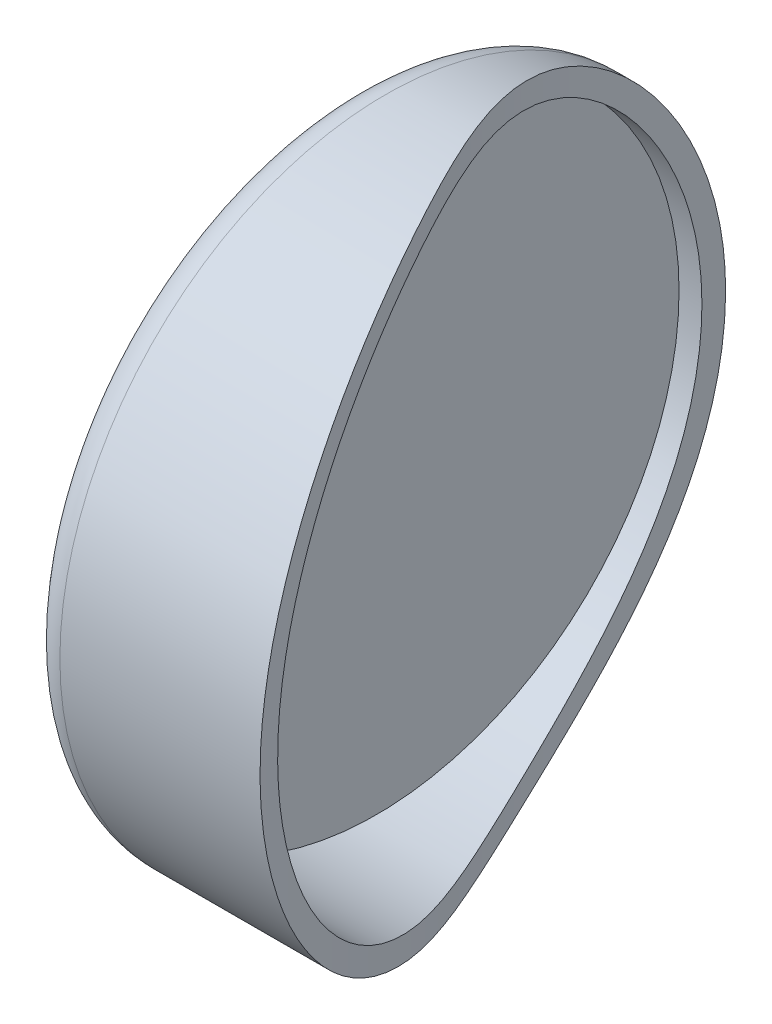
ISO-10303-21;
HEADER;
FILE_DESCRIPTION(('STEP AP214'),'2;1');
FILE_NAME('part.step','',(''),(''),'','','');
FILE_SCHEMA(('AUTOMOTIVE_DESIGN { 1 0 10303 214 1 1 1 1 }'));
ENDSEC;
DATA;
#1=APPLICATION_CONTEXT('core data for automotive mechanical design processes');
#2=APPLICATION_PROTOCOL_DEFINITION('international standard','automotive_design',2000,#1);
#3=PRODUCT_CONTEXT('',#1,'mechanical');
#4=PRODUCT('Part','Part','',(#3));
#5=PRODUCT_RELATED_PRODUCT_CATEGORY('part','',(#4));
#6=PRODUCT_DEFINITION_FORMATION('','',#4);
#7=PRODUCT_DEFINITION_CONTEXT('part definition',#1,'design');
#8=PRODUCT_DEFINITION('design','',#6,#7);
#9=PRODUCT_DEFINITION_SHAPE('','',#8);
#10=(LENGTH_UNIT() NAMED_UNIT(*) SI_UNIT(.MILLI.,.METRE.));
#11=(NAMED_UNIT(*) PLANE_ANGLE_UNIT() SI_UNIT($,.RADIAN.));
#12=(NAMED_UNIT(*) SI_UNIT($,.STERADIAN.) SOLID_ANGLE_UNIT());
#13=UNCERTAINTY_MEASURE_WITH_UNIT(LENGTH_MEASURE(1.E-05),#10,'distance_accuracy_value','');
#14=(GEOMETRIC_REPRESENTATION_CONTEXT(3) GLOBAL_UNCERTAINTY_ASSIGNED_CONTEXT((#13)) GLOBAL_UNIT_ASSIGNED_CONTEXT((#10,
#11,#12)) REPRESENTATION_CONTEXT('',''));
#15=CARTESIAN_POINT('',(0.,0.,0.));
#16=DIRECTION('',(0.,0.,1.));
#17=DIRECTION('',(1.,0.,0.));
#18=AXIS2_PLACEMENT_3D('',#15,#16,#17);
#19=CARTESIAN_POINT('',(50.,0.,0.));
#20=DIRECTION('',(-1.,0.,0.));
#21=DIRECTION('',(0.,0.,1.));
#22=AXIS2_PLACEMENT_3D('',#19,#20,#21);
#23=CYLINDRICAL_SURFACE('',#22,70.);
#24=CARTESIAN_POINT('',(7.,0.,0.));
#25=DIRECTION('',(1.,0.,0.));
#26=DIRECTION('',(0.,0.,-1.));
#27=AXIS2_PLACEMENT_3D('',#24,#25,#26);
#28=CIRCLE('',#27,70.);
#29=CARTESIAN_POINT('',(7.,0.,-70.));
#30=VERTEX_POINT('',#29);
#31=EDGE_CURVE('E52',#30,#30,#28,.T.);
#32=ORIENTED_EDGE('',*,*,#31,.T.);
#33=EDGE_LOOP('',(#32));
#34=FACE_BOUND('',#33,.T.);
#35=CARTESIAN_POINT('',(50.,0.,70.));
#36=CARTESIAN_POINT('',(50.0000018003316,1.91130000398539,69.9999962525769));
#37=CARTESIAN_POINT('',(49.9823059619208,3.82266490187084,69.9216631907981));
#38=CARTESIAN_POINT('',(49.9107786034703,7.63195740908031,69.6089486036693));
#39=CARTESIAN_POINT('',(49.8569455766294,9.52988445475555,69.3745605713471));
#40=CARTESIAN_POINT('',(49.7110853451611,13.298961887616,68.7516272956741));
#41=CARTESIAN_POINT('',(49.6190550008448,15.1701100605876,68.3630693802023));
#42=CARTESIAN_POINT('',(49.3939428916241,18.8720619893456,67.4350547678297));
#43=CARTESIAN_POINT('',(49.2608617481148,20.7028663553758,66.8956003550947));
#44=CARTESIAN_POINT('',(48.9505515883576,24.3113521581381,65.6703082779987));
#45=CARTESIAN_POINT('',(48.7733145159935,26.0890238346137,64.9844439048544));
#46=CARTESIAN_POINT('',(48.3719560001871,29.5781725991728,63.4724097122345));
#47=CARTESIAN_POINT('',(48.1478345356526,31.2896496574761,62.6462398296384));
#48=CARTESIAN_POINT('',(47.6506613438221,34.6341848102122,60.86103950687));
#49=CARTESIAN_POINT('',(47.3776144183036,36.2672505803761,59.9020221070789));
#50=CARTESIAN_POINT('',(46.7813553529707,39.4439895004782,57.8596360224635));
#51=CARTESIAN_POINT('',(46.4581432229093,40.9876626677959,56.7762673618155));
#52=CARTESIAN_POINT('',(45.7618353126724,43.9728757710367,54.4968512209325));
#53=CARTESIAN_POINT('',(45.3888303684963,45.4145945419111,53.3010100686265));
#54=CARTESIAN_POINT('',(44.5929291213869,48.190206523011,50.8053836716068));
#55=CARTESIAN_POINT('',(44.1700329584453,49.5241000357696,49.5055987185563));
#56=CARTESIAN_POINT('',(43.2753925222116,52.0767967651697,46.812923744282));
#57=CARTESIAN_POINT('',(42.8036417238308,53.2955845664718,45.4200212949936));
#58=CARTESIAN_POINT('',(41.8128483553499,55.6119088401151,42.5524623568207));
#59=CARTESIAN_POINT('',(41.2938048433208,56.7094428964819,41.0778042398379));
#60=CARTESIAN_POINT('',(40.3794236056434,58.4556011825207,38.5295906756666));
#61=CARTESIAN_POINT('',(39.995984212328,59.1374837269307,37.4743593249841));
#62=CARTESIAN_POINT('',(39.2082563656509,60.4404359608465,35.3344390659105));
#63=CARTESIAN_POINT('',(38.803967418465,61.0615042089472,34.2497494600854));
#64=CARTESIAN_POINT('',(37.9752201629652,62.2418240149578,32.0547696084488));
#65=CARTESIAN_POINT('',(37.5507617294224,62.8010751889844,30.9444792037084));
#66=CARTESIAN_POINT('',(36.6823773872359,63.8569983359353,28.7022508909051));
#67=CARTESIAN_POINT('',(36.2384546631374,64.3536804946315,27.5703165409622));
#68=CARTESIAN_POINT('',(35.3316242416914,65.2841450392752,25.2883080234928));
#69=CARTESIAN_POINT('',(34.8687168042539,65.7179282859708,24.1382341044382));
#70=CARTESIAN_POINT('',(34.1605388654334,66.3212257353159,22.402464514663));
#71=CARTESIAN_POINT('',(33.9221682900473,66.51443449884,21.8220779847266));
#72=CARTESIAN_POINT('',(33.4408441507808,66.8850746069647,20.6581641324341));
#73=CARTESIAN_POINT('',(33.1978906495045,67.062506166897,20.0746368530592));
#74=CARTESIAN_POINT('',(32.7567089219999,67.3675392623906,19.0223941749003));
#75=CARTESIAN_POINT('',(32.5592985218957,67.4979914500122,18.5541586718265));
#76=CARTESIAN_POINT('',(32.1615756327022,67.7488307492125,17.6162309447409));
#77=CARTESIAN_POINT('',(31.9612631764652,67.8692179746267,17.1465387372667));
#78=CARTESIAN_POINT('',(31.5579662400618,68.099971499391,16.2058152093342));
#79=CARTESIAN_POINT('',(31.3549816403137,68.2103373485156,15.734783829691));
#80=CARTESIAN_POINT('',(30.946662312012,68.4210833977731,14.7915140927725));
#81=CARTESIAN_POINT('',(30.7413275750215,68.5214635620455,14.319275731169));
#82=CARTESIAN_POINT('',(30.122232236501,68.8076974343487,12.9008318853234));
#83=CARTESIAN_POINT('',(29.7053893942726,68.9786394560444,11.9529183148476));
#84=CARTESIAN_POINT('',(28.8662186125377,69.2810006459276,10.0532607918036));
#85=CARTESIAN_POINT('',(28.4438906404444,69.4124195791994,9.10151681650242));
#86=CARTESIAN_POINT('',(27.595858839554,69.6361051990004,7.19289203604649));
#87=CARTESIAN_POINT('',(27.1701503602873,69.7283022098274,6.23600512200615));
#88=CARTESIAN_POINT('',(26.3191547951072,69.8732344656959,4.31913380809848));
#89=CARTESIAN_POINT('',(25.8938676849327,69.9259721325379,3.35914960195867));
#90=CARTESIAN_POINT('',(25.0467884748518,69.991875964692,1.43624233619641));
#91=CARTESIAN_POINT('',(24.6249964783283,70.0050409636096,0.47331919078682));
#92=CARTESIAN_POINT('',(23.7879949621204,69.9915150958389,-1.4553026518381));
#93=CARTESIAN_POINT('',(23.3727865723823,69.9648174607671,-2.42100179260845));
#94=CARTESIAN_POINT('',(22.5085018262151,69.8661450251981,-4.45740766110544));
#95=CARTESIAN_POINT('',(22.0605171785261,69.7896588296474,-5.52836432245546));
#96=CARTESIAN_POINT('',(21.1805109326669,69.5866117243761,-7.67221166687009));
#97=CARTESIAN_POINT('',(20.7484906137398,69.4600468112537,-8.7451024977289));
#98=CARTESIAN_POINT('',(19.9042218988581,69.1559939890128,-10.8914255270733));
#99=CARTESIAN_POINT('',(19.4919725657759,68.9785084962758,-11.964857697458));
#100=CARTESIAN_POINT('',(18.6905294533441,68.5717310470367,-14.1106404103873));
#101=CARTESIAN_POINT('',(18.3013373608329,68.3424353060558,-15.1829908681679));
#102=CARTESIAN_POINT('',(17.5498597092219,67.8319653328452,-17.3213568419703));
#103=CARTESIAN_POINT('',(17.1875038101539,67.5509339785347,-18.3873816560336));
#104=CARTESIAN_POINT('',(16.4906433722979,66.9359760726796,-20.5134027174912));
#105=CARTESIAN_POINT('',(16.1561413566166,66.6020447371957,-21.5733984106603));
#106=CARTESIAN_POINT('',(15.5165191133858,65.8810422115986,-23.6839951573259));
#107=CARTESIAN_POINT('',(15.2113949025932,65.4939782428823,-24.734597466869));
#108=CARTESIAN_POINT('',(14.6312785639093,64.6667924266737,-26.8228828704973));
#109=CARTESIAN_POINT('',(14.3562801854709,64.2266816253588,-27.8605686047764));
#110=CARTESIAN_POINT('',(13.8010099571301,63.2301833421241,-30.0598177833477));
#111=CARTESIAN_POINT('',(13.5251135270588,62.6661228327089,-31.2190213390867));
#112=CARTESIAN_POINT('',(13.011326826359,61.4710446598636,-33.5109071863992));
#113=CARTESIAN_POINT('',(12.7734340457399,60.8400314229811,-34.6435912252615));
#114=CARTESIAN_POINT('',(12.333854117487,59.5126784688247,-36.8772114946731));
#115=CARTESIAN_POINT('',(12.1321658208053,58.8163408258673,-37.9781487318627));
#116=CARTESIAN_POINT('',(11.7623832390699,57.3598177610642,-40.1441923584439));
#117=CARTESIAN_POINT('',(11.5943182763706,56.5995774240628,-41.2092668051838));
#118=CARTESIAN_POINT('',(11.2890779783303,55.018248739185,-43.2978978767897));
#119=CARTESIAN_POINT('',(11.1519033205706,54.1971590570984,-44.3214535905354));
#120=CARTESIAN_POINT('',(10.9052640321049,52.4970736852052,-46.3225793045326));
#121=CARTESIAN_POINT('',(10.7957978854337,51.6180811666486,-47.3001518181957));
#122=CARTESIAN_POINT('',(10.5638150743501,49.4563423753804,-49.5720104752358));
#123=CARTESIAN_POINT('',(10.4524672424479,48.1483157113886,-50.8435285410729));
#124=CARTESIAN_POINT('',(10.2677596510069,45.435716050429,-53.2815356800938));
#125=CARTESIAN_POINT('',(10.1943970516486,44.031150279731,-54.4480325993907));
#126=CARTESIAN_POINT('',(10.0773330183528,41.1347612746575,-56.6679766408525));
#127=CARTESIAN_POINT('',(10.0336239765413,39.6429605279277,-57.7214527010509));
#128=CARTESIAN_POINT('',(9.96826236017668,36.5812333208901,-59.7088341594736));
#129=CARTESIAN_POINT('',(9.94661092548707,35.0113028274945,-60.6427333761859));
#130=CARTESIAN_POINT('',(9.91789279828104,31.7153076487677,-62.432728815322));
#131=CARTESIAN_POINT('',(9.91168899033256,29.9854000882016,-63.2817715472802));
#132=CARTESIAN_POINT('',(9.90963057033029,26.4614692253321,-64.8343903711833));
#133=CARTESIAN_POINT('',(9.91377625696378,24.6674440740624,-65.5379622641929));
#134=CARTESIAN_POINT('',(9.92690900767121,21.0271909461663,-66.7949525017638));
#135=CARTESIAN_POINT('',(9.9358969405273,19.1809536581247,-67.3483438745592));
#136=CARTESIAN_POINT('',(9.95442410362848,15.4491474555595,-68.3010427693062));
#137=CARTESIAN_POINT('',(9.9639633366546,13.5635783426586,-68.700349513905));
#138=CARTESIAN_POINT('',(9.98069434019879,9.72605989045413,-69.3488966953937));
#139=CARTESIAN_POINT('',(9.98783266929288,7.77354781380426,-69.5948134151373));
#140=CARTESIAN_POINT('',(9.99751835051571,3.8547012137418,-69.9214359056832));
#141=CARTESIAN_POINT('',(10.0000656266398,1.88836646203667,-70.0021389413863));
#142=CARTESIAN_POINT('',(9.99993169721231,-2.04406650629275,-69.9977744782511));
#143=CARTESIAN_POINT('',(9.99725045001398,-4.01016472090822,-69.9127056589933));
#144=CARTESIAN_POINT('',(9.98732402555103,-7.92846657601206,-69.5773265396055));
#145=CARTESIAN_POINT('',(9.98007886408241,-9.88067026456663,-69.3270168113848));
#146=CARTESIAN_POINT('',(9.96731124831394,-12.7879971193687,-68.8290335349409));
#147=CARTESIAN_POINT('',(9.96273656611362,-13.7539839048279,-68.6425222345954));
#148=CARTESIAN_POINT('',(9.95334461017676,-15.6772152950928,-68.2289668116408));
#149=CARTESIAN_POINT('',(9.94852735912667,-16.6344607075866,-68.0019264745069));
#150=CARTESIAN_POINT('',(9.93910173505499,-18.5386086016579,-67.5076864516678));
#151=CARTESIAN_POINT('',(9.9344933822661,-19.4855100746676,-67.240482886752));
#152=CARTESIAN_POINT('',(9.92602756218746,-21.3671303601561,-66.6664316827342));
#153=CARTESIAN_POINT('',(9.92217002457231,-22.3018503059629,-66.3595877610451));
#154=CARTESIAN_POINT('',(9.91582738289556,-24.1577060829675,-65.7067199036378));
#155=CARTESIAN_POINT('',(9.91334253589435,-25.0788393384055,-65.3606886440135));
#156=CARTESIAN_POINT('',(9.91045318599057,-26.9056199120294,-64.6301417881728));
#157=CARTESIAN_POINT('',(9.91004848704367,-27.8112686815381,-64.2456298220675));
#158=CARTESIAN_POINT('',(9.9121083648527,-29.6056405703085,-63.4387409206909));
#159=CARTESIAN_POINT('',(9.91457321785877,-30.4943620516179,-63.0163603434433));
#160=CARTESIAN_POINT('',(9.92324431748104,-32.2531149258016,-62.1345650745391));
#161=CARTESIAN_POINT('',(9.92945020744462,-33.1231480921431,-61.6751539168176));
#162=CARTESIAN_POINT('',(9.94655729286336,-34.8431509957535,-60.7200346663467));
#163=CARTESIAN_POINT('',(9.95745906068776,-35.6931182739139,-60.2243221550278));
#164=CARTESIAN_POINT('',(9.98498969290842,-37.3712576458986,-59.1976061975909));
#165=CARTESIAN_POINT('',(10.0016180017531,-38.1994318455588,-58.6666061788674));
#166=CARTESIAN_POINT('',(10.0417133348979,-39.8326448286116,-57.5701995666731));
#167=CARTESIAN_POINT('',(10.0651810927974,-40.6376811200508,-57.0047892875077));
#168=CARTESIAN_POINT('',(10.120133531042,-42.2229606282549,-55.8407425206644));
#169=CARTESIAN_POINT('',(10.1516174150298,-43.003206299174,-55.2421093381136));
#170=CARTESIAN_POINT('',(10.2238533783861,-44.5376024616365,-54.0126699692889));
#171=CARTESIAN_POINT('',(10.2646062994534,-45.2917505761537,-53.3818608652352));
#172=CARTESIAN_POINT('',(10.3566773588878,-46.7723778991138,-52.0894444651618));
#173=CARTESIAN_POINT('',(10.4079944302186,-47.4988598932092,-51.4278402848302));
#174=CARTESIAN_POINT('',(10.5225481870651,-48.9229050475497,-50.0750820657441));
#175=CARTESIAN_POINT('',(10.585785708671,-49.6204661751205,-49.383925956873));
#176=CARTESIAN_POINT('',(10.7255442842335,-50.9852059708672,-47.9736558333663));
#177=CARTESIAN_POINT('',(10.8020643537504,-51.6523868860583,-47.2545438937479));
#178=CARTESIAN_POINT('',(10.9954453810907,-53.1545361657706,-45.5657052763155));
#179=CARTESIAN_POINT('',(11.1174855679789,-53.9783735020094,-44.5866267002481));
#180=CARTESIAN_POINT('',(11.3896072386892,-55.5694010164453,-42.5872518302571));
#181=CARTESIAN_POINT('',(11.5396884652288,-56.3365917142974,-41.5669559145789));
#182=CARTESIAN_POINT('',(11.8707271293927,-57.8119043943884,-39.4893259895876));
#183=CARTESIAN_POINT('',(12.051684225645,-58.5200270295709,-38.4319923898759));
#184=CARTESIAN_POINT('',(12.4467723318948,-59.8743953988679,-36.2858819065703));
#185=CARTESIAN_POINT('',(12.6608706085665,-60.520701180842,-35.1971369019401));
#186=CARTESIAN_POINT('',(13.1243412655142,-61.7504798330987,-32.9919992815944));
#187=CARTESIAN_POINT('',(13.3737140309426,-62.3339520171964,-31.875606364109));
#188=CARTESIAN_POINT('',(13.908989341291,-63.4367223363465,-29.6202266058435));
#189=CARTESIAN_POINT('',(14.1948888764819,-63.9560257518435,-28.481241633126));
#190=CARTESIAN_POINT('',(14.7870007668948,-64.9031297731725,-26.248299369771));
#191=CARTESIAN_POINT('',(15.0912501527951,-65.3343793700186,-25.155281493156));
#192=CARTESIAN_POINT('',(15.7322959111235,-66.1386694474769,-22.9574760107763));
#193=CARTESIAN_POINT('',(16.0690916587054,-66.5117110452442,-21.8526886313323));
#194=CARTESIAN_POINT('',(16.7739052056624,-67.1997703987994,-19.635137655809));
#195=CARTESIAN_POINT('',(17.1419213644498,-67.5147912007409,-18.5223744816561));
#196=CARTESIAN_POINT('',(17.9073654319662,-68.0876333249757,-16.2911640324334));
#197=CARTESIAN_POINT('',(18.304818180291,-68.3454055884976,-15.1727127159646));
#198=CARTESIAN_POINT('',(19.1259266504068,-68.8042352773989,-12.9337991694097));
#199=CARTESIAN_POINT('',(19.5495831537237,-69.0052910102146,-11.8133368803152));
#200=CARTESIAN_POINT('',(20.4194749878796,-69.351650935617,-9.57256070212649));
#201=CARTESIAN_POINT('',(20.8657111432286,-69.4969530906623,-8.45224681995128));
#202=CARTESIAN_POINT('',(21.8029236228948,-69.7396021865805,-6.14864083354949));
#203=CARTESIAN_POINT('',(22.2949950537794,-69.833691207904,-4.96545207312956));
#204=CARTESIAN_POINT('',(23.2943371738176,-69.9616214851268,-2.60227870028331));
#205=CARTESIAN_POINT('',(23.8016079566184,-69.9954623697438,-1.4222941076476));
#206=CARTESIAN_POINT('',(24.8256968585898,-70.0036851984277,0.933745043314098));
#207=CARTESIAN_POINT('',(25.3425152266848,-69.9780655900655,2.10979949822696));
#208=CARTESIAN_POINT('',(26.3801605579951,-69.8677959374934,4.45792566584816));
#209=CARTESIAN_POINT('',(26.9009890560284,-69.7831220541234,5.62999557799192));
#210=CARTESIAN_POINT('',(27.940791430971,-69.554823454001,7.9691566593811));
#211=CARTESIAN_POINT('',(28.4597653612317,-69.4112004470686,9.13624797203889));
#212=CARTESIAN_POINT('',(29.4905725156273,-69.0647472471468,11.4650119451505));
#213=CARTESIAN_POINT('',(30.0024049318957,-68.8619104117292,12.6266839828249));
#214=CARTESIAN_POINT('',(30.8120443784411,-68.4894331984931,14.4810771709049));
#215=CARTESIAN_POINT('',(31.1137627088467,-68.3388396558175,15.1759689701381));
#216=CARTESIAN_POINT('',(31.711812066947,-68.0159703259904,16.5630573984598));
#217=CARTESIAN_POINT('',(32.0081430357659,-67.8436943020439,17.2552539980288));
#218=CARTESIAN_POINT('',(32.5945677433735,-67.4773054021987,18.6366258499878));
#219=CARTESIAN_POINT('',(32.8846606393817,-67.2831895974916,19.32580068424));
#220=CARTESIAN_POINT('',(33.4585450360848,-66.8731231894858,20.7002375834037));
#221=CARTESIAN_POINT('',(33.7423365426429,-66.6571726065044,21.3854996519554));
#222=CARTESIAN_POINT('',(34.5841868069969,-65.9765152834804,23.4343850894553));
#223=CARTESIAN_POINT('',(35.1327529772339,-65.4789831966058,24.7911824192496));
#224=CARTESIAN_POINT('',(36.2035570538037,-64.3968867861036,27.4798267175134));
#225=CARTESIAN_POINT('',(36.7257997534032,-63.8123383845579,28.8116782004386));
#226=CARTESIAN_POINT('',(37.7431651507648,-62.5568502822304,31.4446754537666));
#227=CARTESIAN_POINT('',(38.2382883585922,-61.885912207067,32.7458218014115));
#228=CARTESIAN_POINT('',(39.2003681881327,-60.4588293643387,35.3112440322753));
#229=CARTESIAN_POINT('',(39.6673270991599,-59.7026915365417,36.5755229079128));
#230=CARTESIAN_POINT('',(40.4340311659548,-58.3503227318509,38.6819569344223));
#231=CARTESIAN_POINT('',(40.7413451358505,-57.775640745325,39.5352724520332));
#232=CARTESIAN_POINT('',(41.3415406580416,-56.5865981296316,41.2191597451639));
#233=CARTESIAN_POINT('',(41.634421383488,-55.9722352318794,42.0497302164617));
#234=CARTESIAN_POINT('',(42.2053453880156,-54.7047999337175,43.6858743300623));
#235=CARTESIAN_POINT('',(42.4833906062773,-54.0517326161155,44.4914512335377));
#236=CARTESIAN_POINT('',(43.0244145553462,-52.7076910073253,46.0757915620899));
#237=CARTESIAN_POINT('',(43.2873913392361,-52.0167118402125,46.854551517119));
#238=CARTESIAN_POINT('',(43.7978831058259,-50.5982557336537,48.3828803567587));
#239=CARTESIAN_POINT('',(44.0454030795314,-49.8707907137394,49.1324586343871));
#240=CARTESIAN_POINT('',(44.5248145729283,-48.3804951071009,50.6006092747624));
#241=CARTESIAN_POINT('',(44.7567082413308,-47.617669407132,51.3191858955154));
#242=CARTESIAN_POINT('',(45.2047475062317,-46.0578775183973,52.7235548805792));
#243=CARTESIAN_POINT('',(45.420892196653,-45.2609093695157,53.4093453578443));
#244=CARTESIAN_POINT('',(45.837289854133,-43.6344722960641,54.7461497338164));
#245=CARTESIAN_POINT('',(46.0375442650606,-42.8050063346592,55.3971667904461));
#246=CARTESIAN_POINT('',(46.4667163085624,-40.9192982182619,56.809341588844));
#247=CARTESIAN_POINT('',(46.6915267393653,-39.8550364864804,57.5610756164554));
#248=CARTESIAN_POINT('',(47.1171074831838,-37.6829216727783,59.0059224768428));
#249=CARTESIAN_POINT('',(47.3178790091129,-36.5750707939539,59.6990382667576));
#250=CARTESIAN_POINT('',(47.695704434641,-34.3192663598594,61.0237556021824));
#251=CARTESIAN_POINT('',(47.8727584905377,-33.1713130689265,61.6553575530601));
#252=CARTESIAN_POINT('',(48.2035844912864,-30.8395677737362,62.8541084885402));
#253=CARTESIAN_POINT('',(48.3573656522964,-29.6557901800674,63.4212829643678));
#254=CARTESIAN_POINT('',(48.642423673114,-27.2559184703907,64.4890661809768));
#255=CARTESIAN_POINT('',(48.7737004219448,-26.0398241950525,64.989674593496));
#256=CARTESIAN_POINT('',(49.014586615354,-23.5796416636083,65.9221606539311));
#257=CARTESIAN_POINT('',(49.1241977689297,-22.3355556241421,66.3540437224266));
#258=CARTESIAN_POINT('',(49.3576779423004,-19.3813178675982,67.2869552993888));
#259=CARTESIAN_POINT('',(49.4729947376274,-17.6611914058929,67.7588492994192));
#260=CARTESIAN_POINT('',(49.6682954562463,-14.1882899948075,68.5702031230302));
#261=CARTESIAN_POINT('',(49.7482822990257,-12.4355177555876,68.9096738891221));
#262=CARTESIAN_POINT('',(49.8752092462098,-8.90783752196351,69.4538371441957));
#263=CARTESIAN_POINT('',(49.9221470389537,-7.13292798797118,69.6585202052026));
#264=CARTESIAN_POINT('',(49.9845425967004,-3.57203166614209,69.9316078084237));
#265=CARTESIAN_POINT('',(49.999998317652,-1.78604416659201,70.0000035018381));
#266=CARTESIAN_POINT('',(50.,0.,70.));
#267=B_SPLINE_CURVE_WITH_KNOTS('',3,(#35,#36,#37,#38,#39,#40,#41,#42,#43,#44,#45,#46,#47,#48,
#49,#50,#51,#52,#53,#54,#55,#56,#57,#58,#59,#60,#61,#62,#63,#64,#65,#66,#67,#68,#69,#70,#71,#72,
#73,#74,#75,#76,#77,#78,#79,#80,#81,#82,#83,#84,#85,#86,#87,#88,#89,#90,#91,#92,#93,#94,#95,#96,
#97,#98,#99,#100,#101,#102,#103,#104,#105,#106,#107,#108,#109,#110,#111,#112,#113,#114,#115,
#116,#117,#118,#119,#120,#121,#122,#123,#124,#125,#126,#127,#128,#129,#130,#131,#132,#133,#134,
#135,#136,#137,#138,#139,#140,#141,#142,#143,#144,#145,#146,#147,#148,#149,#150,#151,#152,#153,
#154,#155,#156,#157,#158,#159,#160,#161,#162,#163,#164,#165,#166,#167,#168,#169,#170,#171,#172,
#173,#174,#175,#176,#177,#178,#179,#180,#181,#182,#183,#184,#185,#186,#187,#188,#189,#190,#191,
#192,#193,#194,#195,#196,#197,#198,#199,#200,#201,#202,#203,#204,#205,#206,#207,#208,#209,#210,
#211,#212,#213,#214,#215,#216,#217,#218,#219,#220,#221,#222,#223,#224,#225,#226,#227,#228,#229,
#230,#231,#232,#233,#234,#235,#236,#237,#238,#239,#240,#241,#242,#243,#244,#245,#246,#247,#248,
#249,#250,#251,#252,#253,#254,#255,#256,#257,#258,#259,#260,#261,#262,#263,#264,#265,#266),
.UNSPECIFIED.,.T.,.F.,(4,2,2,2,2,2,2,2,2,2,2,2,2,2,2,2,2,2,2,2,2,2,2,2,2,2,2,2,2,2,2,2,2,2,2,2,
2,2,2,2,2,2,2,2,2,2,2,2,2,2,2,2,2,2,2,2,2,2,2,2,2,2,2,2,2,2,2,2,2,2,2,2,2,2,2,2,2,2,2,2,2,2,2,2,
2,2,2,2,2,2,2,2,2,2,2,2,2,2,2,2,2,2,2,2,2,2,2,2,2,2,2,2,2,2,2,4),(0.,5.73232724515714,
11.4648935242275,17.1979310939649,22.9308818856839,28.6648794039657,34.3988795018679,
40.1323171456726,45.8657536747916,51.5888702178755,57.3119707026305,63.0358365603669,
68.7598164452608,72.6988080881981,76.637893069533,80.5770025111676,84.5154698640293,
88.4538833153499,90.4232259813796,92.3925417651457,93.9663212990974,95.5400830310857,
97.1139154317817,98.6877534842219,101.835498742536,104.983262709904,108.136595399106,
111.289734537978,114.442966613924,117.596734146493,121.085755718443,124.575056266754,
128.064191261433,131.553581202363,135.033475273509,138.513684224073,141.993420637693,
145.472433698161,149.424904764328,153.377114677401,157.329199134133,161.284715257065,
165.240318136108,169.195704552655,174.672117989316,180.148121943908,185.622720450958,
191.097601852624,196.872061354525,202.646687509746,208.422350077313,214.198041782554,
220.094892508131,225.991840854808,231.888836172532,237.785811080492,240.736611211653,
243.687135877558,246.63794570655,249.588479013646,252.5395646727,255.490372200457,
258.441463824272,261.392274149587,264.343444243895,267.294328115595,270.245528615651,
273.196436044746,276.147611545686,279.098489108083,282.04957371959,285.000439703966,
288.854293198848,292.70811133553,296.561886866122,300.411880053284,304.261915280683,
308.111633477602,311.75103926627,315.390375197161,319.029520004534,322.671771422965,
326.314131523832,329.956624723837,333.809692108517,337.662783237848,341.515974967044,
345.370723062179,349.22535935821,353.080428221954,355.397312783621,357.714222650234,
360.031443595599,362.348662384806,366.982849759148,371.616190218514,376.249443503758,
380.882319669476,384.102462941044,387.322790473619,390.542696033941,393.763016688423,
396.982292066068,400.201123866805,403.420140708764,406.638864719294,410.603258376912,
414.567451921654,418.53161934113,422.494212803661,426.4568258065,430.419126110772,
435.775509268886,441.131449719898,446.487764762267,451.844427565522),.UNSPECIFIED.);
#268=CARTESIAN_POINT('',(50.,0.,70.));
#269=VERTEX_POINT('',#268);
#270=EDGE_CURVE('E70',#269,#269,#267,.T.);
#271=ORIENTED_EDGE('',*,*,#270,.T.);
#272=EDGE_LOOP('',(#271));
#273=FACE_BOUND('',#272,.T.);
#274=ADVANCED_FACE('F38',(#34,#273),#23,.T.);
#275=CARTESIAN_POINT('',(0.,0.,0.));
#276=DIRECTION('',(1.,0.,0.));
#277=DIRECTION('',(0.,0.,-1.));
#278=AXIS2_PLACEMENT_3D('',#275,#276,#277);
#279=PLANE('',#278);
#280=CARTESIAN_POINT('',(0.,0.,0.));
#281=DIRECTION('',(1.,0.,0.));
#282=DIRECTION('',(0.,0.,-1.));
#283=AXIS2_PLACEMENT_3D('',#280,#281,#282);
#284=CIRCLE('',#283,50.);
#285=CARTESIAN_POINT('',(0.,0.,-50.));
#286=VERTEX_POINT('',#285);
#287=EDGE_CURVE('E10',#286,#286,#284,.F.);
#288=ORIENTED_EDGE('',*,*,#287,.F.);
#289=EDGE_LOOP('',(#288));
#290=FACE_BOUND('',#289,.T.);
#291=CARTESIAN_POINT('',(0.,0.,0.));
#292=DIRECTION('',(1.,0.,0.));
#293=DIRECTION('',(0.,0.,-1.));
#294=AXIS2_PLACEMENT_3D('',#291,#292,#293);
#295=CIRCLE('',#294,63.);
#296=CARTESIAN_POINT('',(0.,0.,-63.));
#297=VERTEX_POINT('',#296);
#298=EDGE_CURVE('E46',#297,#297,#295,.F.);
#299=ORIENTED_EDGE('',*,*,#298,.T.);
#300=EDGE_LOOP('',(#299));
#301=FACE_BOUND('',#300,.T.);
#302=ADVANCED_FACE('F83',(#290,#301),#279,.F.);
#303=CARTESIAN_POINT('',(10.,-82.5,-70.));
#304=CARTESIAN_POINT('',(8.73620530707256,-82.5,-29.113153139026));
#305=CARTESIAN_POINT('',(29.4581274122779,-82.5,5.56852855779937));
#306=CARTESIAN_POINT('',(46.8114824522961,-82.5,55.9434066319831));
#307=CARTESIAN_POINT('',(50.,-82.5,70.));
#308=B_SPLINE_CURVE_WITH_KNOTS('',3,(#303,#304,#305,#306,#307),.UNSPECIFIED.,.F.,.F.,(4,1,4),
(0.,0.596241341737801,1.),.UNSPECIFIED.);
#309=DIRECTION('',(0.,1.,0.));
#310=VECTOR('',#309,1.);
#311=SURFACE_OF_LINEAR_EXTRUSION('',#308,#310);
#312=CARTESIAN_POINT('',(9.91191605319725,0.,-65.));
#313=CARTESIAN_POINT('',(9.91191716700093,0.912734634114015,-65.0000020314265));
#314=CARTESIAN_POINT('',(9.91183671377505,1.82541887811777,-64.9807738992799));
#315=CARTESIAN_POINT('',(9.91155490284834,3.64924336859707,-64.9038983036968));
#316=CARTESIAN_POINT('',(9.91135353873551,4.56038353061904,-64.8462488027324));
#317=CARTESIAN_POINT('',(9.91094066739805,6.37931135454855,-64.6926375434972));
#318=CARTESIAN_POINT('',(9.91072916139129,7.28709940495946,-64.5966803752578));
#319=CARTESIAN_POINT('',(9.91048299015547,9.09791429843924,-64.3666141156314));
#320=CARTESIAN_POINT('',(9.9104483410837,10.0009406989656,-64.2325015396282));
#321=CARTESIAN_POINT('',(9.91081712467045,11.8002637481487,-63.9264134243084));
#322=CARTESIAN_POINT('',(9.91122042096286,12.6965624041912,-63.7544496842633));
#323=CARTESIAN_POINT('',(9.91280058395169,14.4812078285637,-63.3729226837012));
#324=CARTESIAN_POINT('',(9.91397752272158,15.3695538481998,-63.1633559213634));
#325=CARTESIAN_POINT('',(9.91751487850994,17.1365624613144,-62.7070234475705));
#326=CARTESIAN_POINT('',(9.9198752005664,18.015225826008,-62.4602607220614));
#327=CARTESIAN_POINT('',(9.92626382612886,19.7614574395025,-61.9299406664347));
#328=CARTESIAN_POINT('',(9.93029228561859,20.6290246429037,-61.6463798971192));
#329=CARTESIAN_POINT('',(9.94057530903783,22.3516110630802,-61.0429226288192));
#330=CARTESIAN_POINT('',(9.94683028192047,23.2066279446248,-60.7230194620272));
#331=CARTESIAN_POINT('',(9.96220114653218,24.9024405345369,-60.0474965181876));
#332=CARTESIAN_POINT('',(9.97131731067085,25.7432348807624,-59.6918733424862));
#333=CARTESIAN_POINT('',(10.0039909692131,28.2418091603261,-58.5724320263285));
#334=CARTESIAN_POINT('',(10.0328756773599,29.8762476914936,-57.755878301705));
#335=CARTESIAN_POINT('',(10.1113013396172,33.070505984937,-55.9881597909865));
#336=CARTESIAN_POINT('',(10.1608456931756,34.6303134199081,-55.0369728686513));
#337=CARTESIAN_POINT('',(10.2562995413164,36.9049803029387,-53.5150050533142));
#338=CARTESIAN_POINT('',(10.2916466917712,37.6524601985088,-52.9917393726196));
#339=CARTESIAN_POINT('',(10.3704298577076,39.1244353775719,-51.9144487469054));
#340=CARTESIAN_POINT('',(10.4138650498324,39.8489329918664,-51.3604269368637));
#341=CARTESIAN_POINT('',(10.5095845467038,41.2689864325381,-50.2263988911502));
#342=CARTESIAN_POINT('',(10.5618097152722,41.964699317567,-49.6465841926866));
#343=CARTESIAN_POINT('',(10.6763878707207,43.3307629031048,-48.4588902956353));
#344=CARTESIAN_POINT('',(10.7387398221831,44.0011161878877,-47.8510139707652));
#345=CARTESIAN_POINT('',(10.8746961523197,45.3153421495766,-46.6083437978651));
#346=CARTESIAN_POINT('',(10.9483017152063,45.9592120305871,-45.973547122105));
#347=CARTESIAN_POINT('',(11.1078748223203,47.2191205841402,-44.6785258335079));
#348=CARTESIAN_POINT('',(11.1938410886231,47.835162125104,-44.0183038544534));
#349=CARTESIAN_POINT('',(11.3792119491126,49.0380677373473,-42.6741256661012));
#350=CARTESIAN_POINT('',(11.478610714727,49.6249443135278,-41.9901798461033));
#351=CARTESIAN_POINT('',(11.6919377372299,50.7686552605942,-40.5999234626993));
#352=CARTESIAN_POINT('',(11.8058644737627,51.325492766411,-39.8936152453292));
#353=CARTESIAN_POINT('',(12.0492752366816,52.4082109604101,-38.4601894556188));
#354=CARTESIAN_POINT('',(12.1787600390826,52.9340901024808,-37.733070846664));
#355=CARTESIAN_POINT('',(12.4541844993862,53.9538928518362,-36.2598957106267));
#356=CARTESIAN_POINT('',(12.6001228931905,54.4478189094337,-35.5138406418044));
#357=CARTESIAN_POINT('',(12.9528397809887,55.5375758899214,-33.7918310862806));
#358=CARTESIAN_POINT('',(13.1651738768673,56.1229004094198,-32.8103360085777));
#359=CARTESIAN_POINT('',(13.6194917077998,57.2383515925901,-30.8231971679849));
#360=CARTESIAN_POINT('',(13.8614750304077,57.7684790239104,-29.8175537411755));
#361=CARTESIAN_POINT('',(14.3758157521201,58.7725192745743,-27.7862283881047));
#362=CARTESIAN_POINT('',(14.6481718152478,59.2464345645769,-26.7605473448544));
#363=CARTESIAN_POINT('',(15.2232657754259,60.1373350404527,-24.6934666380017));
#364=CARTESIAN_POINT('',(15.52599558632,60.5543353089408,-23.6520712203031));
#365=CARTESIAN_POINT('',(16.1612616986899,61.3313667104905,-21.5571716757608));
#366=CARTESIAN_POINT('',(16.4937989370503,61.6913960519009,-20.5036671692213));
#367=CARTESIAN_POINT('',(17.1872654842917,62.3546490314032,-18.3882175779581));
#368=CARTESIAN_POINT('',(17.5481940761765,62.6578741033788,-17.3262727069961));
#369=CARTESIAN_POINT('',(18.2919736584593,63.2048529922829,-15.2094628568582));
#370=CARTESIAN_POINT('',(18.6745216971971,63.4492560214107,-14.1546586956716));
#371=CARTESIAN_POINT('',(19.462564306738,63.8838065610739,-12.0425009473765));
#372=CARTESIAN_POINT('',(19.8680585829071,64.0739547680621,-10.9851473931695));
#373=CARTESIAN_POINT('',(20.6987329069021,64.4008430025937,-8.86998639600362));
#374=CARTESIAN_POINT('',(21.1239124554266,64.5375843839299,-7.81217896523053));
#375=CARTESIAN_POINT('',(21.9908079457432,64.7586595564594,-5.69638515917822));
#376=CARTESIAN_POINT('',(22.4325432951791,64.8429296624594,-4.63840011935573));
#377=CARTESIAN_POINT('',(23.3280636645711,64.9595745187789,-2.52469336602352));
#378=CARTESIAN_POINT('',(23.781848758687,64.9919489496325,-1.46897166648669));
#379=CARTESIAN_POINT('',(24.6973500877923,65.0054048200406,0.639506233302819));
#380=CARTESIAN_POINT('',(25.1590673076478,64.9864798437644,1.69226204613946));
#381=CARTESIAN_POINT('',(26.0277123399298,64.9032972887355,3.66155653647029));
#382=CARTESIAN_POINT('',(26.4342128709454,64.8450524973698,4.57854392273251));
#383=CARTESIAN_POINT('',(27.2472163525695,64.6897595742514,6.40928851007467));
#384=CARTESIAN_POINT('',(27.653719302342,64.5927095636602,7.32304555258912));
#385=CARTESIAN_POINT('',(28.4639916517974,64.3597741639856,9.14683424268667));
#386=CARTESIAN_POINT('',(28.8677610130133,64.2238882295631,10.0568658377745));
#387=CARTESIAN_POINT('',(29.6699704553553,63.9131368008624,11.8726306533128));
#388=CARTESIAN_POINT('',(30.0684104475121,63.7382706567022,12.778363801842));
#389=CARTESIAN_POINT('',(30.8573855013226,63.3493953255773,14.5844788020282));
#390=CARTESIAN_POINT('',(31.2479235136582,63.1354010606587,15.484862559054));
#391=CARTESIAN_POINT('',(31.8262214202736,62.784838326884,16.8308959514093));
#392=CARTESIAN_POINT('',(32.0177403553318,62.6630522641107,17.2788273531364));
#393=CARTESIAN_POINT('',(32.3980246730795,62.4095800702969,18.1730645702092));
#394=CARTESIAN_POINT('',(32.586790052227,62.2778939265228,18.6193703834633));
#395=CARTESIAN_POINT('',(32.9615305296629,62.0046173788828,19.5101114333896));
#396=CARTESIAN_POINT('',(33.147505656032,61.8630270747727,19.9545466888546));
#397=CARTESIAN_POINT('',(33.5166445831394,61.5699441850585,20.8413061147075));
#398=CARTESIAN_POINT('',(33.6998083974621,61.4184516473211,21.2836302952893));
#399=CARTESIAN_POINT('',(34.2450567994734,60.9491152582082,22.6071161574342));
#400=CARTESIAN_POINT('',(34.6028998388593,60.6164115426758,23.4847947101819));
#401=CARTESIAN_POINT('',(35.4492537159516,59.7690791241004,25.581261719512));
#402=CARTESIAN_POINT('',(35.9321492529194,59.2352549567072,26.7946088305138));
#403=CARTESIAN_POINT('',(36.8743123692521,58.0903359414237,29.1938339094065));
#404=CARTESIAN_POINT('',(37.3335778737855,57.4792343244321,30.3797094601522));
#405=CARTESIAN_POINT('',(38.227589070574,56.1807843249769,32.7186277652626));
#406=CARTESIAN_POINT('',(38.6623335951964,55.4934323162606,33.8716689548381));
#407=CARTESIAN_POINT('',(39.5063823385389,54.043928646355,36.1395198177269));
#408=CARTESIAN_POINT('',(39.9156854026088,53.2817735943026,37.2543277548118));
#409=CARTESIAN_POINT('',(40.7079239194052,51.6846225665695,39.4402331801147));
#410=CARTESIAN_POINT('',(41.0908603824497,50.8496293846898,40.5113323425285));
#411=CARTESIAN_POINT('',(41.8295234940348,49.1092178714083,42.6044234158409));
#412=CARTESIAN_POINT('',(42.1852531533919,48.2038073551091,43.6264207558812));
#413=CARTESIAN_POINT('',(42.8371760534045,46.4123383584405,45.5240193691859));
#414=CARTESIAN_POINT('',(43.1358322776012,45.5322466955325,46.4044149409347));
#415=CARTESIAN_POINT('',(43.7097504734102,43.7188863424022,48.1166686936789));
#416=CARTESIAN_POINT('',(43.9850137522954,42.7856206285917,48.9485295861328));
#417=CARTESIAN_POINT('',(44.5118529411565,40.8686959109604,50.5600395137192));
#418=CARTESIAN_POINT('',(44.7634291087571,39.8850374553986,51.3396891166834));
#419=CARTESIAN_POINT('',(45.2426238455044,37.8709210920447,52.8428953722313));
#420=CARTESIAN_POINT('',(45.4702539014154,36.8404859653826,53.5664788749996));
#421=CARTESIAN_POINT('',(45.9016910220321,34.7358046300043,54.9546463707673));
#422=CARTESIAN_POINT('',(46.1054977545427,33.6615578106547,55.6192295410286));
#423=CARTESIAN_POINT('',(46.489437342166,31.4729741086833,56.8862936641986));
#424=CARTESIAN_POINT('',(46.669571575025,30.3586395639913,57.4887782308237));
#425=CARTESIAN_POINT('',(46.9567210807137,28.4283815515703,58.4604608201796));
#426=CARTESIAN_POINT('',(47.0696204005346,27.6215085162658,58.8460108130841));
#427=CARTESIAN_POINT('',(47.2839864814434,25.9912029223169,59.5840409989135));
#428=CARTESIAN_POINT('',(47.3854526050666,25.1677694433484,59.9365193477257));
#429=CARTESIAN_POINT('',(47.5771078007386,23.5060107231203,60.607510468385));
#430=CARTESIAN_POINT('',(47.6672982143533,22.6676872670267,60.9260272802559));
#431=CARTESIAN_POINT('',(47.8366275036183,20.9775015508412,61.5284438225063));
#432=CARTESIAN_POINT('',(47.9157653312863,20.1256380154261,61.8123402699344));
#433=CARTESIAN_POINT('',(48.0631865221105,18.4101211142698,62.3447991474488));
#434=CARTESIAN_POINT('',(48.1314711376777,17.5464691213704,62.593365654098));
#435=CARTESIAN_POINT('',(48.2574237833285,15.8087900802301,63.0546613244487));
#436=CARTESIAN_POINT('',(48.3150907711338,14.9347620223788,63.2673869696618));
#437=CARTESIAN_POINT('',(48.420009485326,13.1781179917166,63.656472006182));
#438=CARTESIAN_POINT('',(48.4672622079478,12.2955028487928,63.83283487587));
#439=CARTESIAN_POINT('',(48.5515611864818,10.5231527274531,64.1488394283018));
#440=CARTESIAN_POINT('',(48.5886064843159,9.6334170887609,64.2884776639826));
#441=CARTESIAN_POINT('',(48.6520342195152,7.86585695740968,64.5283524169838));
#442=CARTESIAN_POINT('',(48.6786093896799,6.98813579805505,64.6293000943985));
#443=CARTESIAN_POINT('',(48.7222313097984,5.22899152949119,64.7953567522335));
#444=CARTESIAN_POINT('',(48.7392771844156,4.34756808768981,64.8604624402926));
#445=CARTESIAN_POINT('',(48.7639203551561,2.5827647769853,64.954677225287));
#446=CARTESIAN_POINT('',(48.7715186848232,1.69938513268115,64.9837902597491));
#447=CARTESIAN_POINT('',(48.7773094289381,-0.0679397750850054,65.0059723604378));
#448=CARTESIAN_POINT('',(48.7755009642014,-0.951885083695421,64.999038057582));
#449=CARTESIAN_POINT('',(48.7624675095424,-2.71857684471709,64.9491351086757));
#450=CARTESIAN_POINT('',(48.7512437194983,-3.6013234355345,64.9061710542156));
#451=CARTESIAN_POINT('',(48.7193229244478,-5.36423910354253,64.7843015656787));
#452=CARTESIAN_POINT('',(48.6986250343427,-6.24440793217737,64.705392773541));
#453=CARTESIAN_POINT('',(48.6476554629895,-8.00046017927143,64.5118031893592));
#454=CARTESIAN_POINT('',(48.6173846467384,-8.87634397766193,64.3971256293473));
#455=CARTESIAN_POINT('',(48.5471291437066,-10.6223547450062,64.1322513558064));
#456=CARTESIAN_POINT('',(48.5071435491787,-11.4924811681826,63.9820513230988));
#457=CARTESIAN_POINT('',(48.3723448677802,-14.092075107477,63.4785605581224));
#458=CARTESIAN_POINT('',(48.2626865306624,-15.810874755588,63.0723661845705));
#459=CARTESIAN_POINT('',(48.0022314123343,-19.2066304396585,62.1225791203108));
#460=CARTESIAN_POINT('',(47.8514347818229,-20.8835866288755,61.5789869329227));
#461=CARTESIAN_POINT('',(47.5070537128326,-24.183863331677,60.3592144406706));
#462=CARTESIAN_POINT('',(47.3134744689414,-25.8071903293389,59.6830502335857));
#463=CARTESIAN_POINT('',(46.8821156959905,-28.988965790138,58.2041045990327));
#464=CARTESIAN_POINT('',(46.6443361874839,-30.5474142834432,57.4013232304415));
#465=CARTESIAN_POINT('',(46.1236480391651,-33.5886335276171,55.6763817834586));
#466=CARTESIAN_POINT('',(45.840744194479,-35.0714122974358,54.754234391427));
#467=CARTESIAN_POINT('',(45.2293916352146,-37.9517108437056,52.7986525373481));
#468=CARTESIAN_POINT('',(44.9009430350032,-39.3492308342364,51.7652183547533));
#469=CARTESIAN_POINT('',(44.1986382044948,-42.0505255891297,49.5959164773463));
#470=CARTESIAN_POINT('',(43.824773731508,-43.3542832676708,48.4600301977974));
#471=CARTESIAN_POINT('',(43.032360349162,-45.86033497092,46.0955190445502));
#472=CARTESIAN_POINT('',(42.6138107090276,-47.0626273357023,44.8668926542893));
#473=CARTESIAN_POINT('',(41.8740040951233,-48.9922276836841,42.733123976723));
#474=CARTESIAN_POINT('',(41.5643736124027,-49.7485872633583,41.8500086116906));
#475=CARTESIAN_POINT('',(40.925439640986,-51.2097296355124,40.0488207385338));
#476=CARTESIAN_POINT('',(40.5961358789707,-51.9145117111273,39.1307477448102));
#477=CARTESIAN_POINT('',(39.918398420054,-53.2709857617214,37.2630420642191));
#478=CARTESIAN_POINT('',(39.5699649286834,-53.9226783069104,36.3134097164702));
#479=CARTESIAN_POINT('',(38.8546395086395,-55.1715881783082,34.3862438913047));
#480=CARTESIAN_POINT('',(38.4877542934544,-55.7688250983736,33.4087206169572));
#481=CARTESIAN_POINT('',(37.7359773426996,-56.9081345355336,31.4287898816674));
#482=CARTESIAN_POINT('',(37.3510855535909,-57.4502068885922,30.426382346741));
#483=CARTESIAN_POINT('',(36.5638295431338,-58.4784896417735,28.3999495188913));
#484=CARTESIAN_POINT('',(36.1614648154304,-58.9646984215141,27.3759235999233));
#485=CARTESIAN_POINT('',(35.4255009285022,-59.7851896675812,25.5251114226485));
#486=CARTESIAN_POINT('',(35.0950560937584,-60.1300120546367,24.7017179754799));
#487=CARTESIAN_POINT('',(34.4237779059194,-60.7841913076678,23.0450664738873));
#488=CARTESIAN_POINT('',(34.0829443345102,-61.0935474276868,22.2118082123848));
#489=CARTESIAN_POINT('',(33.5640942266171,-61.5308839283239,20.9558326393042));
#490=CARTESIAN_POINT('',(33.3898723256327,-61.6722169156654,20.5361469755394));
#491=CARTESIAN_POINT('',(33.0389095054205,-61.9459891008977,19.6949248626165));
#492=CARTESIAN_POINT('',(32.862168589541,-62.078428310609,19.2733884159192));
#493=CARTESIAN_POINT('',(32.5061904273703,-62.3344037955475,18.4286965042204));
#494=CARTESIAN_POINT('',(32.3269533037628,-62.4579405064857,18.0055411195229));
#495=CARTESIAN_POINT('',(31.966023606136,-62.6961263005347,17.1577858229829));
#496=CARTESIAN_POINT('',(31.7843310307082,-62.8107753785472,16.7331859103119));
#497=CARTESIAN_POINT('',(31.2353264762879,-63.1417937649868,15.4560133084302));
#498=CARTESIAN_POINT('',(30.8646468989642,-63.3448330357492,14.601392826996));
#499=CARTESIAN_POINT('',(30.1162601894073,-63.7155999502506,12.8876298804329));
#500=CARTESIAN_POINT('',(29.7385530935659,-63.8833277767937,12.0284874387374));
#501=CARTESIAN_POINT('',(28.9781405324124,-64.1836906033519,10.3062120940679));
#502=CARTESIAN_POINT('',(28.5954347405658,-64.3163232986622,9.44307893280772));
#503=CARTESIAN_POINT('',(27.8272389360357,-64.5466160338348,7.71334454633482));
#504=CARTESIAN_POINT('',(27.4417487137133,-64.6442734118182,6.84674306223039));
#505=CARTESIAN_POINT('',(26.4950221261492,-64.8410915406782,4.71601152822024));
#506=CARTESIAN_POINT('',(25.9335104532708,-64.9207772059132,3.45015293162932));
#507=CARTESIAN_POINT('',(24.8168804933703,-65.0059777221116,0.913143284996321));
#508=CARTESIAN_POINT('',(24.2617622892273,-65.0114916126599,-0.358007833362912));
#509=CARTESIAN_POINT('',(23.1652750249966,-64.9475616070317,-2.90458105214404));
#510=CARTESIAN_POINT('',(22.623907552445,-64.8781090958053,-4.18000362664356));
#511=CARTESIAN_POINT('',(21.5631511359673,-64.6631979671061,-6.73098945645886));
#512=CARTESIAN_POINT('',(21.0437250974817,-64.5178736747387,-8.00654849280367));
#513=CARTESIAN_POINT('',(20.032541323015,-64.1498378449251,-10.5573953858398));
#514=CARTESIAN_POINT('',(19.5407810079751,-63.9271335349481,-11.8326832567311));
#515=CARTESIAN_POINT('',(18.5907682970229,-63.4028748552595,-14.3793171170818));
#516=CARTESIAN_POINT('',(18.1325085476354,-63.1013378564635,-15.6506639125932));
#517=CARTESIAN_POINT('',(17.3282847563055,-62.475939050155,-17.9707086063721));
#518=CARTESIAN_POINT('',(16.9764320822955,-62.1644652083323,-19.0207184408864));
#519=CARTESIAN_POINT('',(16.3009003419053,-61.4857932094711,-21.1117321849349));
#520=CARTESIAN_POINT('',(15.9772195717822,-61.1185984259395,-22.1527366356507));
#521=CARTESIAN_POINT('',(15.359254973342,-60.328381605378,-24.2221600356856));
#522=CARTESIAN_POINT('',(15.0649697590092,-59.9053622026927,-25.2505795763814));
#523=CARTESIAN_POINT('',(14.5063076116683,-59.0038060263253,-27.2909250758807));
#524=CARTESIAN_POINT('',(14.2419267598708,-58.5252765435958,-28.3028531808788));
#525=CARTESIAN_POINT('',(13.7428297494947,-57.5133030117502,-30.3064298277531));
#526=CARTESIAN_POINT('',(13.508115220973,-56.9798559480317,-31.2980772527724));
#527=CARTESIAN_POINT('',(13.0675654157628,-55.859104941088,-33.2570844732016));
#528=CARTESIAN_POINT('',(12.8617298878797,-55.2718014663888,-34.2244444798077));
#529=CARTESIAN_POINT('',(12.5256387661335,-54.1981640614219,-35.8926485658744));
#530=CARTESIAN_POINT('',(12.3893504759893,-53.7232770552271,-36.5996809612121));
#531=CARTESIAN_POINT('',(12.1315603626337,-52.7446898136957,-37.9963781222888));
#532=CARTESIAN_POINT('',(12.0100594947816,-52.2409877198124,-38.6860417636178));
#533=CARTESIAN_POINT('',(11.7810679605606,-51.2056512392708,-40.046371434936));
#534=CARTESIAN_POINT('',(11.6735761879616,-50.6740190627724,-40.7170389616786));
#535=CARTESIAN_POINT('',(11.4717047920119,-49.5836064623425,-42.0380728083574));
#536=CARTESIAN_POINT('',(11.3773264057924,-49.0248234836772,-42.688437208393));
#537=CARTESIAN_POINT('',(11.2007428332141,-47.880929585184,-43.9676359903369));
#538=CARTESIAN_POINT('',(11.1185411880251,-47.2958110708572,-44.596464068461));
#539=CARTESIAN_POINT('',(10.9653811399691,-46.1003348517873,-45.8311861653218));
#540=CARTESIAN_POINT('',(10.8944237886084,-45.4899747933117,-46.437078035159));
#541=CARTESIAN_POINT('',(10.7628009521396,-44.245157691627,-47.6246357378472));
#542=CARTESIAN_POINT('',(10.7021346170602,-43.6107026438103,-48.2063035684498));
#543=CARTESIAN_POINT('',(10.590120756602,-42.3186669501869,-49.3444188337247));
#544=CARTESIAN_POINT('',(10.5387740924301,-41.6610841739014,-49.9008639340679));
#545=CARTESIAN_POINT('',(10.4441394378148,-40.3193680837163,-50.9911847243241));
#546=CARTESIAN_POINT('',(10.4009091771513,-39.6350835168632,-51.5248792954051));
#547=CARTESIAN_POINT('',(10.3220093363046,-38.245355026369,-52.5646845058062));
#548=CARTESIAN_POINT('',(10.2863404494363,-37.5399091691781,-53.0707926125199));
#549=CARTESIAN_POINT('',(10.221673961681,-36.1091671910882,-54.0544310806273));
#550=CARTESIAN_POINT('',(10.1926756468799,-35.3838732037295,-54.5319644961596));
#551=CARTESIAN_POINT('',(10.1404948267325,-33.9145714997252,-55.4576966622054));
#552=CARTESIAN_POINT('',(10.1173128203951,-33.1705621834226,-55.9058928933047));
#553=CARTESIAN_POINT('',(10.0552676353211,-30.9121108357172,-57.2053974899745));
#554=CARTESIAN_POINT('',(10.0239035384888,-29.3712044309953,-58.0116499256811));
#555=CARTESIAN_POINT('',(9.97537703560379,-26.2295469752543,-59.4981643162001));
#556=CARTESIAN_POINT('',(9.95821575400908,-24.6287911963558,-60.1784162920609));
#557=CARTESIAN_POINT('',(9.93634174806546,-21.7819048053476,-61.2556533880541));
#558=CARTESIAN_POINT('',(9.92959572715705,-20.5464526558084,-61.6810291256648));
#559=CARTESIAN_POINT('',(9.9196785205867,-18.0519742642284,-62.4566421883423));
#560=CARTESIAN_POINT('',(9.91650771277396,-16.7929455447714,-62.8068715683408));
#561=CARTESIAN_POINT('',(9.91233170869743,-14.2560348740935,-63.4308439328529));
#562=CARTESIAN_POINT('',(9.91132659777428,-12.9781521819177,-63.7045839028836));
#563=CARTESIAN_POINT('',(9.91038689991551,-10.4080744868328,-64.1745950208253));
#564=CARTESIAN_POINT('',(9.91045242354638,-9.11587801948351,-64.3708581654125));
#565=CARTESIAN_POINT('',(9.91087103125682,-6.52207253665597,-64.6851548769799));
#566=CARTESIAN_POINT('',(9.91122410422686,-5.22046388674472,-64.8031914659387));
#567=CARTESIAN_POINT('',(9.91174581172011,-2.61253553187057,-64.9606098044801));
#568=CARTESIAN_POINT('',(9.91191445923082,-1.30621616514412,-64.9999970928219));
#569=CARTESIAN_POINT('',(9.91191605319725,0.,-65.));
#570=B_SPLINE_CURVE_WITH_KNOTS('',3,(#312,#313,#314,#315,#316,#317,#318,#319,#320,#321,#322,
#323,#324,#325,#326,#327,#328,#329,#330,#331,#332,#333,#334,#335,#336,#337,#338,#339,#340,#341,
#342,#343,#344,#345,#346,#347,#348,#349,#350,#351,#352,#353,#354,#355,#356,#357,#358,#359,#360,
#361,#362,#363,#364,#365,#366,#367,#368,#369,#370,#371,#372,#373,#374,#375,#376,#377,#378,#379,
#380,#381,#382,#383,#384,#385,#386,#387,#388,#389,#390,#391,#392,#393,#394,#395,#396,#397,#398,
#399,#400,#401,#402,#403,#404,#405,#406,#407,#408,#409,#410,#411,#412,#413,#414,#415,#416,#417,
#418,#419,#420,#421,#422,#423,#424,#425,#426,#427,#428,#429,#430,#431,#432,#433,#434,#435,#436,
#437,#438,#439,#440,#441,#442,#443,#444,#445,#446,#447,#448,#449,#450,#451,#452,#453,#454,#455,
#456,#457,#458,#459,#460,#461,#462,#463,#464,#465,#466,#467,#468,#469,#470,#471,#472,#473,#474,
#475,#476,#477,#478,#479,#480,#481,#482,#483,#484,#485,#486,#487,#488,#489,#490,#491,#492,#493,
#494,#495,#496,#497,#498,#499,#500,#501,#502,#503,#504,#505,#506,#507,#508,#509,#510,#511,#512,
#513,#514,#515,#516,#517,#518,#519,#520,#521,#522,#523,#524,#525,#526,#527,#528,#529,#530,#531,
#532,#533,#534,#535,#536,#537,#538,#539,#540,#541,#542,#543,#544,#545,#546,#547,#548,#549,#550,
#551,#552,#553,#554,#555,#556,#557,#558,#559,#560,#561,#562,#563,#564,#565,#566,#567,#568,#569),
.UNSPECIFIED.,.T.,.F.,(4,2,2,2,2,2,2,2,2,2,2,2,2,2,2,2,2,2,2,2,2,2,2,2,2,2,2,2,2,2,2,2,2,2,2,2,
2,2,2,2,2,2,2,2,2,2,2,2,2,2,2,2,2,2,2,2,2,2,2,2,2,2,2,2,2,2,2,2,2,2,2,2,2,2,2,2,2,2,2,2,2,2,2,2,
2,2,2,2,2,2,2,2,2,2,2,2,2,2,2,2,2,2,2,2,2,2,2,2,2,2,2,2,2,2,2,2,2,2,2,2,2,2,2,2,2,2,2,2,4),(0.,
2.73791423387204,5.47597367394102,8.21370513767733,10.9516867103374,13.688815982921,
16.4262002859421,19.1633649594015,21.9007856366882,24.6387093672663,27.3768938504534,
32.8517819258624,38.3275712241873,41.066219170812,43.8045884772886,46.5252218594782,
49.2455772441378,51.9662190878083,54.6865798569588,57.4057639865277,60.1246637860197,
62.8436992568437,65.5625259714801,69.047516725161,72.5324590051715,76.0172480567743,
79.5011118305582,82.9850851449178,86.4689705031101,89.9124329839977,93.355851260208,
96.7991822446317,100.246684347801,103.694207673448,107.142162188218,110.155645079314,
113.169273892365,116.182945025265,119.196666406159,122.209240851143,123.715600035588,
125.221961157544,126.728307109466,128.23464578039,131.24731112449,135.477081513818,
139.707222665925,143.937565077871,148.168099342212,152.398471410214,156.628374648443,
160.466727520326,164.304865751482,168.142962233615,171.979209133722,175.815509520493,
179.651586534488,182.354881500298,185.058327115455,187.761450772291,190.46483055971,
193.167898162631,195.871230970604,198.574305063774,201.277632783539,203.928569953597,
206.579750591919,209.230641170517,211.881779513026,214.532580048831,217.183628280862,
219.834437036032,222.485493577629,227.787253117996,233.088993237088,238.390089981781,
243.691184261482,248.991715596588,254.292233621835,259.593715098464,264.895283288079,
268.50344151565,272.111649882741,275.71981949065,279.326685665293,282.933562564916,
286.540544059423,289.395460970599,292.250437917796,293.678010431952,295.105581048729,
296.533081749024,297.960583268155,300.820062708354,303.679527344925,306.539179716577,
309.399049682587,313.558247394107,317.717498961049,321.877228555139,326.02961851949,
330.181620745412,334.332708840649,337.78216700433,341.231416411103,344.680503107147,
348.129137295921,351.577960892347,355.026754488437,357.613656859599,360.200726272132,
362.787591272457,365.374700154997,367.962559934823,370.55066157486,373.138549350306,
375.726676144255,378.332566621188,380.938695933252,383.544546195936,386.150619950617,
391.36261864303,396.575029937636,400.492718197966,404.410820463451,408.32907712138,
412.247738427738,416.166248343033,420.084482293401),.UNSPECIFIED.);
#571=CARTESIAN_POINT('',(9.91191605319725,0.,-65.));
#572=VERTEX_POINT('',#571);
#573=EDGE_CURVE('E61',#572,#572,#570,.T.);
#574=ORIENTED_EDGE('',*,*,#573,.F.);
#575=EDGE_LOOP('',(#574));
#576=FACE_BOUND('',#575,.T.);
#577=ORIENTED_EDGE('',*,*,#270,.F.);
#578=EDGE_LOOP('',(#577));
#579=FACE_BOUND('',#578,.T.);
#580=ADVANCED_FACE('F77',(#576,#579),#311,.F.);
#581=CARTESIAN_POINT('',(5.,0.,0.));
#582=DIRECTION('',(1.,0.,0.));
#583=DIRECTION('',(0.,0.,-1.));
#584=AXIS2_PLACEMENT_3D('',#581,#582,#583);
#585=PLANE('',#584);
#586=CARTESIAN_POINT('',(5.,0.,0.));
#587=DIRECTION('',(1.,0.,0.));
#588=DIRECTION('',(0.,0.,-1.));
#589=AXIS2_PLACEMENT_3D('',#586,#587,#588);
#590=CIRCLE('',#589,65.);
#591=CARTESIAN_POINT('',(5.,0.,-65.));
#592=VERTEX_POINT('',#591);
#593=EDGE_CURVE('E58',#592,#592,#590,.T.);
#594=ORIENTED_EDGE('',*,*,#593,.T.);
#595=EDGE_LOOP('',(#594));
#596=FACE_BOUND('',#595,.T.);
#597=ADVANCED_FACE('F82',(#596),#585,.T.);
#598=CARTESIAN_POINT('',(5.,0.,0.));
#599=DIRECTION('',(1.,0.,0.));
#600=DIRECTION('',(0.,0.,-1.));
#601=AXIS2_PLACEMENT_3D('',#598,#599,#600);
#602=CYLINDRICAL_SURFACE('',#601,65.);
#603=ORIENTED_EDGE('',*,*,#573,.T.);
#604=EDGE_LOOP('',(#603));
#605=FACE_BOUND('',#604,.T.);
#606=ORIENTED_EDGE('',*,*,#593,.F.);
#607=EDGE_LOOP('',(#606));
#608=FACE_BOUND('',#607,.T.);
#609=ADVANCED_FACE('F73',(#605,#608),#602,.F.);
#610=CARTESIAN_POINT('',(7.,0.,0.));
#611=DIRECTION('',(1.,0.,0.));
#612=DIRECTION('',(0.,0.,-1.));
#613=AXIS2_PLACEMENT_3D('',#610,#611,#612);
#614=TOROIDAL_SURFACE('',#613,63.,7.);
#615=ORIENTED_EDGE('',*,*,#298,.F.);
#616=EDGE_LOOP('',(#615));
#617=FACE_BOUND('',#616,.T.);
#618=ORIENTED_EDGE('',*,*,#31,.F.);
#619=EDGE_LOOP('',(#618));
#620=FACE_BOUND('',#619,.T.);
#621=ADVANCED_FACE('F40',(#617,#620),#614,.T.);
#622=CARTESIAN_POINT('',(-2.,0.,0.));
#623=DIRECTION('',(1.,0.,0.));
#624=DIRECTION('',(0.,0.,-1.));
#625=AXIS2_PLACEMENT_3D('',#622,#623,#624);
#626=CYLINDRICAL_SURFACE('',#625,50.);
#627=CARTESIAN_POINT('',(-2.,0.,0.));
#628=DIRECTION('',(-1.,0.,0.));
#629=DIRECTION('',(0.,0.,1.));
#630=AXIS2_PLACEMENT_3D('',#627,#628,#629);
#631=CIRCLE('',#630,50.);
#632=CARTESIAN_POINT('',(-2.,0.,50.));
#633=VERTEX_POINT('',#632);
#634=EDGE_CURVE('E71',#633,#633,#631,.T.);
#635=ORIENTED_EDGE('',*,*,#634,.F.);
#636=EDGE_LOOP('',(#635));
#637=FACE_BOUND('',#636,.T.);
#638=ORIENTED_EDGE('',*,*,#287,.T.);
#639=EDGE_LOOP('',(#638));
#640=FACE_BOUND('',#639,.T.);
#641=ADVANCED_FACE('F85',(#637,#640),#626,.T.);
#642=CARTESIAN_POINT('',(-2.,0.,0.));
#643=DIRECTION('',(-1.,0.,0.));
#644=DIRECTION('',(0.,0.,1.));
#645=AXIS2_PLACEMENT_3D('',#642,#643,#644);
#646=PLANE('',#645);
#647=ORIENTED_EDGE('',*,*,#634,.T.);
#648=EDGE_LOOP('',(#647));
#649=FACE_BOUND('',#648,.T.);
#650=ADVANCED_FACE('F131',(#649),#646,.T.);
#651=CLOSED_SHELL('',(#274,#302,#580,#597,#609,#621,#641,#650));
#652=MANIFOLD_SOLID_BREP('B2',#651);
#653=ADVANCED_BREP_SHAPE_REPRESENTATION('',(#18,#652),#14);
#654=SHAPE_DEFINITION_REPRESENTATION(#9,#653);
ENDSEC;
END-ISO-10303-21;
